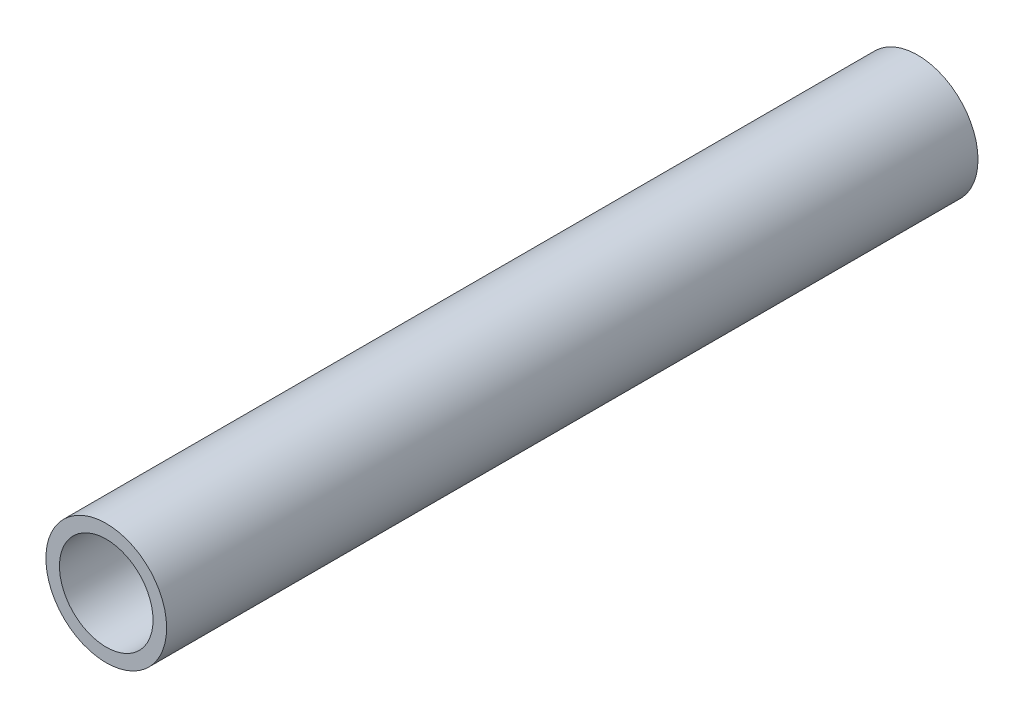
ISO-10303-21;
HEADER;
FILE_DESCRIPTION(('STEP AP214'),'2;1');
FILE_NAME('part.step','',(''),(''),'','','');
FILE_SCHEMA(('AUTOMOTIVE_DESIGN { 1 0 10303 214 1 1 1 1 }'));
ENDSEC;
DATA;
#1=APPLICATION_CONTEXT('core data for automotive mechanical design processes');
#2=APPLICATION_PROTOCOL_DEFINITION('international standard','automotive_design',2000,#1);
#3=PRODUCT_CONTEXT('',#1,'mechanical');
#4=PRODUCT('Part','Part','',(#3));
#5=PRODUCT_RELATED_PRODUCT_CATEGORY('part','',(#4));
#6=PRODUCT_DEFINITION_FORMATION('','',#4);
#7=PRODUCT_DEFINITION_CONTEXT('part definition',#1,'design');
#8=PRODUCT_DEFINITION('design','',#6,#7);
#9=PRODUCT_DEFINITION_SHAPE('','',#8);
#10=(LENGTH_UNIT() NAMED_UNIT(*) SI_UNIT(.MILLI.,.METRE.));
#11=(NAMED_UNIT(*) PLANE_ANGLE_UNIT() SI_UNIT($,.RADIAN.));
#12=(NAMED_UNIT(*) SI_UNIT($,.STERADIAN.) SOLID_ANGLE_UNIT());
#13=UNCERTAINTY_MEASURE_WITH_UNIT(LENGTH_MEASURE(1.E-05),#10,'distance_accuracy_value','');
#14=(GEOMETRIC_REPRESENTATION_CONTEXT(3) GLOBAL_UNCERTAINTY_ASSIGNED_CONTEXT((#13)) GLOBAL_UNIT_ASSIGNED_CONTEXT((#10,
#11,#12)) REPRESENTATION_CONTEXT('',''));
#15=CARTESIAN_POINT('',(0.,0.,0.));
#16=DIRECTION('',(0.,0.,1.));
#17=DIRECTION('',(1.,0.,0.));
#18=AXIS2_PLACEMENT_3D('',#15,#16,#17);
#19=CARTESIAN_POINT('',(0.,0.,682.751999999999));
#20=DIRECTION('',(0.,0.,1.));
#21=DIRECTION('',(1.,0.,0.));
#22=AXIS2_PLACEMENT_3D('',#19,#20,#21);
#23=PLANE('',#22);
#24=CARTESIAN_POINT('',(0.,0.,682.751999999999));
#25=DIRECTION('',(0.,0.,1.));
#26=DIRECTION('',(1.,0.,0.));
#27=AXIS2_PLACEMENT_3D('',#24,#25,#26);
#28=CIRCLE('',#27,50.8);
#29=CARTESIAN_POINT('',(50.8,0.,682.751999999999));
#30=VERTEX_POINT('',#29);
#31=EDGE_CURVE('E10',#30,#30,#28,.T.);
#32=ORIENTED_EDGE('',*,*,#31,.T.);
#33=EDGE_LOOP('',(#32));
#34=FACE_BOUND('',#33,.T.);
#35=CARTESIAN_POINT('',(0.,0.,682.751999999999));
#36=DIRECTION('',(0.,0.,1.));
#37=DIRECTION('',(1.,0.,0.));
#38=AXIS2_PLACEMENT_3D('',#35,#36,#37);
#39=CIRCLE('',#38,39.37);
#40=CARTESIAN_POINT('',(39.37,0.,682.751999999999));
#41=VERTEX_POINT('',#40);
#42=EDGE_CURVE('E50',#41,#41,#39,.T.);
#43=ORIENTED_EDGE('',*,*,#42,.F.);
#44=EDGE_LOOP('',(#43));
#45=FACE_BOUND('',#44,.T.);
#46=ADVANCED_FACE('F37',(#34,#45),#23,.T.);
#47=CARTESIAN_POINT('',(0.,0.,0.));
#48=DIRECTION('',(0.,0.,1.));
#49=DIRECTION('',(1.,0.,0.));
#50=AXIS2_PLACEMENT_3D('',#47,#48,#49);
#51=PLANE('',#50);
#52=CARTESIAN_POINT('',(0.,0.,0.));
#53=DIRECTION('',(0.,0.,1.));
#54=DIRECTION('',(1.,0.,0.));
#55=AXIS2_PLACEMENT_3D('',#52,#53,#54);
#56=CIRCLE('',#55,50.8);
#57=CARTESIAN_POINT('',(50.8,0.,0.));
#58=VERTEX_POINT('',#57);
#59=EDGE_CURVE('E41',#58,#58,#56,.T.);
#60=ORIENTED_EDGE('',*,*,#59,.F.);
#61=EDGE_LOOP('',(#60));
#62=FACE_BOUND('',#61,.T.);
#63=CARTESIAN_POINT('',(0.,0.,0.));
#64=DIRECTION('',(0.,0.,1.));
#65=DIRECTION('',(1.,0.,0.));
#66=AXIS2_PLACEMENT_3D('',#63,#64,#65);
#67=CIRCLE('',#66,39.37);
#68=CARTESIAN_POINT('',(39.37,0.,0.));
#69=VERTEX_POINT('',#68);
#70=EDGE_CURVE('E52',#69,#69,#67,.T.);
#71=ORIENTED_EDGE('',*,*,#70,.T.);
#72=EDGE_LOOP('',(#71));
#73=FACE_BOUND('',#72,.T.);
#74=ADVANCED_FACE('F64',(#62,#73),#51,.F.);
#75=CARTESIAN_POINT('',(0.,0.,682.751999999999));
#76=DIRECTION('',(0.,0.,-1.));
#77=DIRECTION('',(-1.,0.,0.));
#78=AXIS2_PLACEMENT_3D('',#75,#76,#77);
#79=CYLINDRICAL_SURFACE('',#78,50.8);
#80=ORIENTED_EDGE('',*,*,#31,.F.);
#81=EDGE_LOOP('',(#80));
#82=FACE_BOUND('',#81,.T.);
#83=ORIENTED_EDGE('',*,*,#59,.T.);
#84=EDGE_LOOP('',(#83));
#85=FACE_BOUND('',#84,.T.);
#86=ADVANCED_FACE('F39',(#82,#85),#79,.T.);
#87=CARTESIAN_POINT('',(0.,0.,682.751999999999));
#88=DIRECTION('',(0.,0.,-1.));
#89=DIRECTION('',(-1.,0.,0.));
#90=AXIS2_PLACEMENT_3D('',#87,#88,#89);
#91=CYLINDRICAL_SURFACE('',#90,39.37);
#92=ORIENTED_EDGE('',*,*,#42,.T.);
#93=EDGE_LOOP('',(#92));
#94=FACE_BOUND('',#93,.T.);
#95=ORIENTED_EDGE('',*,*,#70,.F.);
#96=EDGE_LOOP('',(#95));
#97=FACE_BOUND('',#96,.T.);
#98=ADVANCED_FACE('F60',(#94,#97),#91,.F.);
#99=CLOSED_SHELL('',(#46,#74,#86,#98));
#100=MANIFOLD_SOLID_BREP('B2',#99);
#101=ADVANCED_BREP_SHAPE_REPRESENTATION('',(#18,#100),#14);
#102=SHAPE_DEFINITION_REPRESENTATION(#9,#101);
ENDSEC;
END-ISO-10303-21;
